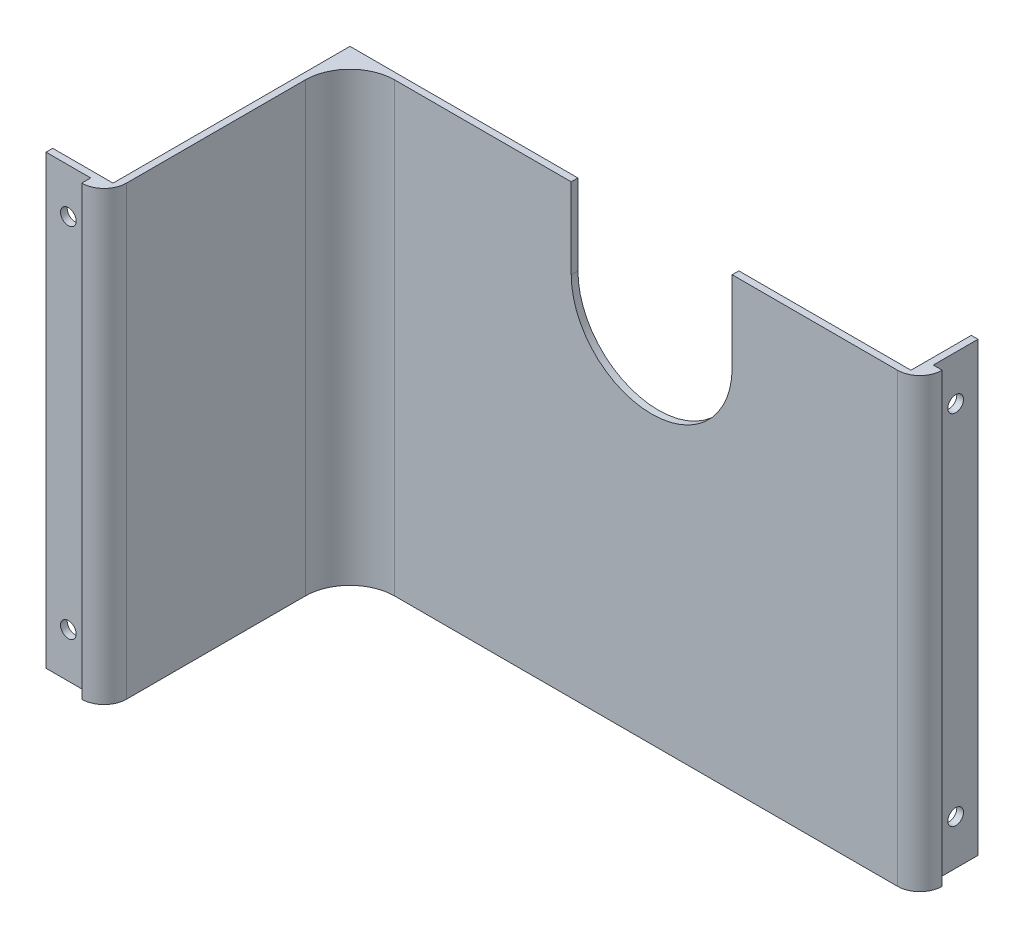
ISO-10303-21;
HEADER;
FILE_DESCRIPTION(('STEP AP214'),'2;1');
FILE_NAME('part.step','',(''),(''),'','','');
FILE_SCHEMA(('AUTOMOTIVE_DESIGN { 1 0 10303 214 1 1 1 1 }'));
ENDSEC;
DATA;
#1=APPLICATION_CONTEXT('core data for automotive mechanical design processes');
#2=APPLICATION_PROTOCOL_DEFINITION('international standard','automotive_design',2000,#1);
#3=PRODUCT_CONTEXT('',#1,'mechanical');
#4=PRODUCT('Part','Part','',(#3));
#5=PRODUCT_RELATED_PRODUCT_CATEGORY('part','',(#4));
#6=PRODUCT_DEFINITION_FORMATION('','',#4);
#7=PRODUCT_DEFINITION_CONTEXT('part definition',#1,'design');
#8=PRODUCT_DEFINITION('design','',#6,#7);
#9=PRODUCT_DEFINITION_SHAPE('','',#8);
#10=(LENGTH_UNIT() NAMED_UNIT(*) SI_UNIT(.MILLI.,.METRE.));
#11=(NAMED_UNIT(*) PLANE_ANGLE_UNIT() SI_UNIT($,.RADIAN.));
#12=(NAMED_UNIT(*) SI_UNIT($,.STERADIAN.) SOLID_ANGLE_UNIT());
#13=UNCERTAINTY_MEASURE_WITH_UNIT(LENGTH_MEASURE(1.E-05),#10,'distance_accuracy_value','');
#14=(GEOMETRIC_REPRESENTATION_CONTEXT(3) GLOBAL_UNCERTAINTY_ASSIGNED_CONTEXT((#13)) GLOBAL_UNIT_ASSIGNED_CONTEXT((#10,
#11,#12)) REPRESENTATION_CONTEXT('',''));
#15=CARTESIAN_POINT('',(0.,0.,0.));
#16=DIRECTION('',(0.,0.,1.));
#17=DIRECTION('',(1.,0.,0.));
#18=AXIS2_PLACEMENT_3D('',#15,#16,#17);
#19=CARTESIAN_POINT('',(-6.10622663543836E-13,100.,-4.99999999999999));
#20=DIRECTION('',(0.,1.,0.));
#21=DIRECTION('',(0.,0.,1.));
#22=AXIS2_PLACEMENT_3D('',#19,#20,#21);
#23=PLANE('',#22);
#24=DIRECTION('',(0.,0.,1.));
#25=VECTOR('',#24,1.);
#26=CARTESIAN_POINT('',(-73.,100.,-5.));
#27=LINE('',#26,#25);
#28=CARTESIAN_POINT('',(-73.,100.,-1.5));
#29=VERTEX_POINT('',#28);
#30=CARTESIAN_POINT('',(-73.0000000000003,100.,0.));
#31=VERTEX_POINT('',#30);
#32=EDGE_CURVE('E11',#29,#31,#27,.T.);
#33=ORIENTED_EDGE('',*,*,#32,.F.);
#34=DIRECTION('',(-1.,0.,0.));
#35=VECTOR('',#34,1.);
#36=CARTESIAN_POINT('',(-124.,100.,-1.49999999999999));
#37=LINE('',#36,#35);
#38=CARTESIAN_POINT('',(-124.,100.,-1.49999999999999));
#39=VERTEX_POINT('',#38);
#40=EDGE_CURVE('E321',#29,#39,#37,.T.);
#41=ORIENTED_EDGE('',*,*,#40,.T.);
#42=DIRECTION('',(0.,0.,1.));
#43=VECTOR('',#42,1.);
#44=CARTESIAN_POINT('',(-124.,100.,51.5));
#45=LINE('',#44,#43);
#46=CARTESIAN_POINT('',(-124.,100.,51.5));
#47=VERTEX_POINT('',#46);
#48=EDGE_CURVE('E324',#39,#47,#45,.T.);
#49=ORIENTED_EDGE('',*,*,#48,.T.);
#50=DIRECTION('',(-1.,0.,0.));
#51=VECTOR('',#50,1.);
#52=CARTESIAN_POINT('',(-137.5,100.,51.5));
#53=LINE('',#52,#51);
#54=CARTESIAN_POINT('',(-137.5,100.,51.5));
#55=VERTEX_POINT('',#54);
#56=EDGE_CURVE('E327',#47,#55,#53,.T.);
#57=ORIENTED_EDGE('',*,*,#56,.T.);
#58=DIRECTION('',(0.,0.,1.));
#59=VECTOR('',#58,1.);
#60=CARTESIAN_POINT('',(-137.5,100.,53.));
#61=LINE('',#60,#59);
#62=CARTESIAN_POINT('',(-137.5,100.,53.));
#63=VERTEX_POINT('',#62);
#64=EDGE_CURVE('E330',#55,#63,#61,.T.);
#65=ORIENTED_EDGE('',*,*,#64,.T.);
#66=DIRECTION('',(1.,0.,0.));
#67=VECTOR('',#66,1.);
#68=CARTESIAN_POINT('',(-127.5,100.,53.));
#69=LINE('',#68,#67);
#70=CARTESIAN_POINT('',(-127.5,100.,53.));
#71=VERTEX_POINT('',#70);
#72=EDGE_CURVE('E333',#63,#71,#69,.T.);
#73=ORIENTED_EDGE('',*,*,#72,.T.);
#74=DIRECTION('',(0.,0.,1.));
#75=VECTOR('',#74,1.);
#76=CARTESIAN_POINT('',(-127.5,100.,55.));
#77=LINE('',#76,#75);
#78=CARTESIAN_POINT('',(-127.5,100.,55.));
#79=VERTEX_POINT('',#78);
#80=EDGE_CURVE('E187',#71,#79,#77,.T.);
#81=ORIENTED_EDGE('',*,*,#80,.T.);
#82=CARTESIAN_POINT('',(-127.5,100.,50.));
#83=DIRECTION('',(0.,1.,0.));
#84=DIRECTION('',(0.,0.,-1.));
#85=AXIS2_PLACEMENT_3D('',#82,#83,#84);
#86=CIRCLE('',#85,5.00000000000001);
#87=CARTESIAN_POINT('',(-122.5,100.,50.));
#88=VERTEX_POINT('',#87);
#89=EDGE_CURVE('E185',#79,#88,#86,.T.);
#90=ORIENTED_EDGE('',*,*,#89,.T.);
#91=DIRECTION('',(0.,0.,-1.));
#92=VECTOR('',#91,1.);
#93=CARTESIAN_POINT('',(-122.5,100.,10.));
#94=LINE('',#93,#92);
#95=CARTESIAN_POINT('',(-122.5,100.,9.99999999999999));
#96=VERTEX_POINT('',#95);
#97=EDGE_CURVE('E167',#88,#96,#94,.T.);
#98=ORIENTED_EDGE('',*,*,#97,.T.);
#99=CARTESIAN_POINT('',(-112.5,100.,10.));
#100=DIRECTION('',(0.,-1.,0.));
#101=DIRECTION('',(0.,0.,1.));
#102=AXIS2_PLACEMENT_3D('',#99,#100,#101);
#103=CIRCLE('',#102,9.99999999999999);
#104=CARTESIAN_POINT('',(-112.5,100.,0.));
#105=VERTEX_POINT('',#104);
#106=EDGE_CURVE('E176',#96,#105,#103,.T.);
#107=ORIENTED_EDGE('',*,*,#106,.T.);
#108=DIRECTION('',(1.,0.,0.));
#109=VECTOR('',#108,1.);
#110=CARTESIAN_POINT('',(0.,100.,0.));
#111=LINE('',#110,#109);
#112=EDGE_CURVE('E191',#105,#31,#111,.T.);
#113=ORIENTED_EDGE('',*,*,#112,.T.);
#114=EDGE_LOOP('',(#33,#41,#49,#57,#65,#73,#81,#90,#98,#107,#113));
#115=FACE_BOUND('',#114,.T.);
#116=ADVANCED_FACE('F37',(#115),#23,.T.);
#117=CARTESIAN_POINT('',(-6.10622663543836E-13,100.,-4.99999999999999));
#118=DIRECTION('',(0.,-1.,0.));
#119=DIRECTION('',(0.,0.,-1.));
#120=AXIS2_PLACEMENT_3D('',#117,#118,#119);
#121=CYLINDRICAL_SURFACE('',#120,5.);
#122=CARTESIAN_POINT('',(-6.10622663543836E-13,3.05311331771918E-13,-5.));
#123=DIRECTION('',(0.,1.,0.));
#124=DIRECTION('',(0.,0.,1.));
#125=AXIS2_PLACEMENT_3D('',#122,#123,#124);
#126=CIRCLE('',#125,5.);
#127=CARTESIAN_POINT('',(0.,0.,0.));
#128=VERTEX_POINT('',#127);
#129=CARTESIAN_POINT('',(4.99999999999939,3.05311331771918E-13,-5.00000000000002));
#130=VERTEX_POINT('',#129);
#131=EDGE_CURVE('E194',#128,#130,#126,.T.);
#132=ORIENTED_EDGE('',*,*,#131,.T.);
#133=DIRECTION('',(0.,-1.,0.));
#134=VECTOR('',#133,1.);
#135=CARTESIAN_POINT('',(4.99999999999939,100.,-5.));
#136=LINE('',#135,#134);
#137=CARTESIAN_POINT('',(4.99999999999939,100.,-5.));
#138=VERTEX_POINT('',#137);
#139=EDGE_CURVE('E269',#138,#130,#136,.T.);
#140=ORIENTED_EDGE('',*,*,#139,.F.);
#141=CARTESIAN_POINT('',(-6.10622663543836E-13,100.,-4.99999999999999));
#142=DIRECTION('',(0.,1.,0.));
#143=DIRECTION('',(0.,0.,1.));
#144=AXIS2_PLACEMENT_3D('',#141,#142,#143);
#145=CIRCLE('',#144,5.);
#146=CARTESIAN_POINT('',(0.,100.,0.));
#147=VERTEX_POINT('',#146);
#148=EDGE_CURVE('E235',#147,#138,#145,.T.);
#149=ORIENTED_EDGE('',*,*,#148,.F.);
#150=DIRECTION('',(0.,-1.,0.));
#151=VECTOR('',#150,1.);
#152=CARTESIAN_POINT('',(0.,100.,0.));
#153=LINE('',#152,#151);
#154=EDGE_CURVE('E193',#147,#128,#153,.T.);
#155=ORIENTED_EDGE('',*,*,#154,.T.);
#156=EDGE_LOOP('',(#132,#140,#149,#155));
#157=FACE_BOUND('',#156,.T.);
#158=ADVANCED_FACE('F39',(#157),#121,.T.);
#159=CARTESIAN_POINT('',(4.99999999999939,100.,-5.));
#160=DIRECTION('',(0.,0.,1.));
#161=DIRECTION('',(1.,0.,0.));
#162=AXIS2_PLACEMENT_3D('',#159,#160,#161);
#163=PLANE('',#162);
#164=DIRECTION('',(-1.,0.,0.));
#165=VECTOR('',#164,1.);
#166=CARTESIAN_POINT('',(4.99999999999939,3.05311331771918E-13,-5.00000000000002));
#167=LINE('',#166,#165);
#168=CARTESIAN_POINT('',(2.99999999999939,3.05311331771918E-13,-5.));
#169=VERTEX_POINT('',#168);
#170=EDGE_CURVE('E197',#130,#169,#167,.T.);
#171=ORIENTED_EDGE('',*,*,#170,.T.);
#172=DIRECTION('',(0.,-1.,0.));
#173=VECTOR('',#172,1.);
#174=CARTESIAN_POINT('',(2.99999999999939,100.,-5.));
#175=LINE('',#174,#173);
#176=CARTESIAN_POINT('',(2.99999999999939,100.,-5.));
#177=VERTEX_POINT('',#176);
#178=EDGE_CURVE('E266',#177,#169,#175,.T.);
#179=ORIENTED_EDGE('',*,*,#178,.F.);
#180=DIRECTION('',(-1.,0.,0.));
#181=VECTOR('',#180,1.);
#182=CARTESIAN_POINT('',(4.99999999999939,100.,-5.));
#183=LINE('',#182,#181);
#184=EDGE_CURVE('E122',#138,#177,#183,.T.);
#185=ORIENTED_EDGE('',*,*,#184,.F.);
#186=ORIENTED_EDGE('',*,*,#139,.T.);
#187=EDGE_LOOP('',(#171,#179,#185,#186));
#188=FACE_BOUND('',#187,.T.);
#189=ADVANCED_FACE('F382',(#188),#163,.F.);
#190=CARTESIAN_POINT('',(2.99999999999939,100.,-5.));
#191=DIRECTION('',(-1.,0.,0.));
#192=DIRECTION('',(0.,0.,1.));
#193=AXIS2_PLACEMENT_3D('',#190,#191,#192);
#194=PLANE('',#193);
#195=CARTESIAN_POINT('',(2.99999999999998,90.,-10.));
#196=DIRECTION('',(1.,0.,0.));
#197=DIRECTION('',(0.,0.,-1.));
#198=AXIS2_PLACEMENT_3D('',#195,#196,#197);
#199=CIRCLE('',#198,1.75);
#200=CARTESIAN_POINT('',(2.99999999999998,90.,-11.75));
#201=VERTEX_POINT('',#200);
#202=EDGE_CURVE('E273',#201,#201,#199,.T.);
#203=ORIENTED_EDGE('',*,*,#202,.F.);
#204=EDGE_LOOP('',(#203));
#205=FACE_BOUND('',#204,.T.);
#206=CARTESIAN_POINT('',(2.99999999999998,9.99999999999999,-10.));
#207=DIRECTION('',(1.,0.,0.));
#208=DIRECTION('',(0.,0.,1.));
#209=AXIS2_PLACEMENT_3D('',#206,#207,#208);
#210=CIRCLE('',#209,1.75);
#211=CARTESIAN_POINT('',(2.99999999999998,9.99999999999999,-8.25000000000002));
#212=VERTEX_POINT('',#211);
#213=EDGE_CURVE('E279',#212,#212,#210,.T.);
#214=ORIENTED_EDGE('',*,*,#213,.F.);
#215=EDGE_LOOP('',(#214));
#216=FACE_BOUND('',#215,.T.);
#217=DIRECTION('',(0.,0.,-1.));
#218=VECTOR('',#217,1.);
#219=CARTESIAN_POINT('',(2.99999999999939,3.05311331771918E-13,-5.));
#220=LINE('',#219,#218);
#221=CARTESIAN_POINT('',(3.,3.05311331771918E-13,-15.));
#222=VERTEX_POINT('',#221);
#223=EDGE_CURVE('E201',#169,#222,#220,.T.);
#224=ORIENTED_EDGE('',*,*,#223,.T.);
#225=DIRECTION('',(0.,-1.,0.));
#226=VECTOR('',#225,1.);
#227=CARTESIAN_POINT('',(3.,100.,-15.));
#228=LINE('',#227,#226);
#229=CARTESIAN_POINT('',(3.,100.,-15.));
#230=VERTEX_POINT('',#229);
#231=EDGE_CURVE('E263',#230,#222,#228,.T.);
#232=ORIENTED_EDGE('',*,*,#231,.F.);
#233=DIRECTION('',(0.,0.,-1.));
#234=VECTOR('',#233,1.);
#235=CARTESIAN_POINT('',(2.99999999999939,100.,-5.));
#236=LINE('',#235,#234);
#237=EDGE_CURVE('E312',#177,#230,#236,.T.);
#238=ORIENTED_EDGE('',*,*,#237,.F.);
#239=ORIENTED_EDGE('',*,*,#178,.T.);
#240=EDGE_LOOP('',(#224,#232,#238,#239));
#241=FACE_BOUND('',#240,.T.);
#242=ADVANCED_FACE('F381',(#205,#216,#241),#194,.F.);
#243=CARTESIAN_POINT('',(3.,100.,-15.));
#244=DIRECTION('',(0.,0.,1.));
#245=DIRECTION('',(1.,0.,0.));
#246=AXIS2_PLACEMENT_3D('',#243,#244,#245);
#247=PLANE('',#246);
#248=DIRECTION('',(-1.,0.,0.));
#249=VECTOR('',#248,1.);
#250=CARTESIAN_POINT('',(3.,3.05311331771918E-13,-15.));
#251=LINE('',#250,#249);
#252=CARTESIAN_POINT('',(1.5,3.05311331771918E-13,-15.));
#253=VERTEX_POINT('',#252);
#254=EDGE_CURVE('E204',#222,#253,#251,.T.);
#255=ORIENTED_EDGE('',*,*,#254,.T.);
#256=DIRECTION('',(0.,-1.,0.));
#257=VECTOR('',#256,1.);
#258=CARTESIAN_POINT('',(1.5,100.,-15.));
#259=LINE('',#258,#257);
#260=CARTESIAN_POINT('',(1.5,100.,-15.));
#261=VERTEX_POINT('',#260);
#262=EDGE_CURVE('E260',#261,#253,#259,.T.);
#263=ORIENTED_EDGE('',*,*,#262,.F.);
#264=DIRECTION('',(-1.,0.,0.));
#265=VECTOR('',#264,1.);
#266=CARTESIAN_POINT('',(3.,100.,-15.));
#267=LINE('',#266,#265);
#268=EDGE_CURVE('E315',#230,#261,#267,.T.);
#269=ORIENTED_EDGE('',*,*,#268,.F.);
#270=ORIENTED_EDGE('',*,*,#231,.T.);
#271=EDGE_LOOP('',(#255,#263,#269,#270));
#272=FACE_BOUND('',#271,.T.);
#273=ADVANCED_FACE('F378',(#272),#247,.F.);
#274=CARTESIAN_POINT('',(1.5,100.,-15.));
#275=DIRECTION('',(1.,0.,0.));
#276=DIRECTION('',(0.,0.,-1.));
#277=AXIS2_PLACEMENT_3D('',#274,#275,#276);
#278=PLANE('',#277);
#279=CARTESIAN_POINT('',(1.49999999999997,90.,-10.));
#280=DIRECTION('',(1.,0.,0.));
#281=DIRECTION('',(0.,0.,-1.));
#282=AXIS2_PLACEMENT_3D('',#279,#280,#281);
#283=CIRCLE('',#282,1.75);
#284=CARTESIAN_POINT('',(1.49999999999997,90.,-11.75));
#285=VERTEX_POINT('',#284);
#286=EDGE_CURVE('E41',#285,#285,#283,.T.);
#287=ORIENTED_EDGE('',*,*,#286,.T.);
#288=EDGE_LOOP('',(#287));
#289=FACE_BOUND('',#288,.T.);
#290=CARTESIAN_POINT('',(1.49999999999997,9.99999999999999,-10.));
#291=DIRECTION('',(1.,0.,0.));
#292=DIRECTION('',(0.,0.,-1.));
#293=AXIS2_PLACEMENT_3D('',#290,#291,#292);
#294=CIRCLE('',#293,1.75);
#295=CARTESIAN_POINT('',(1.49999999999997,9.99999999999999,-11.75));
#296=VERTEX_POINT('',#295);
#297=EDGE_CURVE('E271',#296,#296,#294,.T.);
#298=ORIENTED_EDGE('',*,*,#297,.T.);
#299=EDGE_LOOP('',(#298));
#300=FACE_BOUND('',#299,.T.);
#301=DIRECTION('',(0.,0.,1.));
#302=VECTOR('',#301,1.);
#303=CARTESIAN_POINT('',(1.5,3.05311331771918E-13,-15.));
#304=LINE('',#303,#302);
#305=CARTESIAN_POINT('',(1.49999999999939,3.05311331771918E-13,-1.5));
#306=VERTEX_POINT('',#305);
#307=EDGE_CURVE('E207',#253,#306,#304,.T.);
#308=ORIENTED_EDGE('',*,*,#307,.T.);
#309=DIRECTION('',(0.,-1.,0.));
#310=VECTOR('',#309,1.);
#311=CARTESIAN_POINT('',(1.49999999999939,100.,-1.5));
#312=LINE('',#311,#310);
#313=CARTESIAN_POINT('',(1.49999999999939,100.,-1.5));
#314=VERTEX_POINT('',#313);
#315=EDGE_CURVE('E257',#314,#306,#312,.T.);
#316=ORIENTED_EDGE('',*,*,#315,.F.);
#317=DIRECTION('',(0.,0.,1.));
#318=VECTOR('',#317,1.);
#319=CARTESIAN_POINT('',(1.5,100.,-15.));
#320=LINE('',#319,#318);
#321=EDGE_CURVE('E318',#261,#314,#320,.T.);
#322=ORIENTED_EDGE('',*,*,#321,.F.);
#323=ORIENTED_EDGE('',*,*,#262,.T.);
#324=EDGE_LOOP('',(#308,#316,#322,#323));
#325=FACE_BOUND('',#324,.T.);
#326=ADVANCED_FACE('F375',(#289,#300,#325),#278,.F.);
#327=CARTESIAN_POINT('',(-124.,100.,-1.49999999999999));
#328=DIRECTION('',(0.,0.,1.));
#329=DIRECTION('',(1.,0.,0.));
#330=AXIS2_PLACEMENT_3D('',#327,#328,#329);
#331=PLANE('',#330);
#332=ORIENTED_EDGE('',*,*,#40,.F.);
#333=DIRECTION('',(0.,-1.,0.));
#334=VECTOR('',#333,1.);
#335=CARTESIAN_POINT('',(-73.,100.,-1.5));
#336=LINE('',#335,#334);
#337=CARTESIAN_POINT('',(-73.,82.,-1.5));
#338=VERTEX_POINT('',#337);
#339=EDGE_CURVE('E305',#29,#338,#336,.T.);
#340=ORIENTED_EDGE('',*,*,#339,.T.);
#341=CARTESIAN_POINT('',(-55.,82.0000008613909,-1.5));
#342=DIRECTION('',(0.,0.,1.));
#343=DIRECTION('',(1.,0.,0.));
#344=AXIS2_PLACEMENT_3D('',#341,#342,#343);
#345=CIRCLE('',#344,18.);
#346=CARTESIAN_POINT('',(-37.,82.0000017227817,-1.5));
#347=VERTEX_POINT('',#346);
#348=EDGE_CURVE('E198',#338,#347,#345,.T.);
#349=ORIENTED_EDGE('',*,*,#348,.T.);
#350=DIRECTION('',(0.,1.,0.));
#351=VECTOR('',#350,1.);
#352=CARTESIAN_POINT('',(-37.,100.,-1.5));
#353=LINE('',#352,#351);
#354=CARTESIAN_POINT('',(-37.,100.,-1.5));
#355=VERTEX_POINT('',#354);
#356=EDGE_CURVE('E300',#347,#355,#353,.T.);
#357=ORIENTED_EDGE('',*,*,#356,.T.);
#358=EDGE_CURVE('E322',#314,#355,#37,.T.);
#359=ORIENTED_EDGE('',*,*,#358,.F.);
#360=ORIENTED_EDGE('',*,*,#315,.T.);
#361=DIRECTION('',(-1.,0.,0.));
#362=VECTOR('',#361,1.);
#363=CARTESIAN_POINT('',(-124.,3.05311331771918E-13,-1.5));
#364=LINE('',#363,#362);
#365=CARTESIAN_POINT('',(-124.,3.05311331771918E-13,-1.5));
#366=VERTEX_POINT('',#365);
#367=EDGE_CURVE('E210',#306,#366,#364,.T.);
#368=ORIENTED_EDGE('',*,*,#367,.T.);
#369=DIRECTION('',(0.,-1.,0.));
#370=VECTOR('',#369,1.);
#371=CARTESIAN_POINT('',(-124.,100.,-1.49999999999999));
#372=LINE('',#371,#370);
#373=EDGE_CURVE('E254',#39,#366,#372,.T.);
#374=ORIENTED_EDGE('',*,*,#373,.F.);
#375=EDGE_LOOP('',(#332,#340,#349,#357,#359,#360,#368,#374));
#376=FACE_BOUND('',#375,.T.);
#377=ADVANCED_FACE('F361',(#376),#331,.F.);
#378=CARTESIAN_POINT('',(-124.,100.,51.5));
#379=DIRECTION('',(1.,0.,0.));
#380=DIRECTION('',(0.,0.,-1.));
#381=AXIS2_PLACEMENT_3D('',#378,#379,#380);
#382=PLANE('',#381);
#383=DIRECTION('',(0.,0.,1.));
#384=VECTOR('',#383,1.);
#385=CARTESIAN_POINT('',(-124.,0.,51.5));
#386=LINE('',#385,#384);
#387=CARTESIAN_POINT('',(-124.,0.,51.5));
#388=VERTEX_POINT('',#387);
#389=EDGE_CURVE('E213',#366,#388,#386,.T.);
#390=ORIENTED_EDGE('',*,*,#389,.T.);
#391=DIRECTION('',(0.,-1.,0.));
#392=VECTOR('',#391,1.);
#393=CARTESIAN_POINT('',(-124.,100.,51.5));
#394=LINE('',#393,#392);
#395=EDGE_CURVE('E251',#47,#388,#394,.T.);
#396=ORIENTED_EDGE('',*,*,#395,.F.);
#397=ORIENTED_EDGE('',*,*,#48,.F.);
#398=ORIENTED_EDGE('',*,*,#373,.T.);
#399=EDGE_LOOP('',(#390,#396,#397,#398));
#400=FACE_BOUND('',#399,.T.);
#401=ADVANCED_FACE('F365',(#400),#382,.F.);
#402=CARTESIAN_POINT('',(-137.5,100.,51.5));
#403=DIRECTION('',(0.,0.,1.));
#404=DIRECTION('',(1.,0.,0.));
#405=AXIS2_PLACEMENT_3D('',#402,#403,#404);
#406=PLANE('',#405);
#407=CARTESIAN_POINT('',(-132.5,90.,51.5));
#408=DIRECTION('',(0.,0.,1.));
#409=DIRECTION('',(1.,0.,0.));
#410=AXIS2_PLACEMENT_3D('',#407,#408,#409);
#411=CIRCLE('',#410,1.75000000000001);
#412=CARTESIAN_POINT('',(-130.75,90.,51.5));
#413=VERTEX_POINT('',#412);
#414=EDGE_CURVE('E284',#413,#413,#411,.T.);
#415=ORIENTED_EDGE('',*,*,#414,.T.);
#416=EDGE_LOOP('',(#415));
#417=FACE_BOUND('',#416,.T.);
#418=CARTESIAN_POINT('',(-132.5,9.99999999999999,51.5));
#419=DIRECTION('',(0.,0.,1.));
#420=DIRECTION('',(1.,0.,0.));
#421=AXIS2_PLACEMENT_3D('',#418,#419,#420);
#422=CIRCLE('',#421,1.75000000000001);
#423=CARTESIAN_POINT('',(-130.75,9.99999999999999,51.5));
#424=VERTEX_POINT('',#423);
#425=EDGE_CURVE('E535',#424,#424,#422,.T.);
#426=ORIENTED_EDGE('',*,*,#425,.T.);
#427=EDGE_LOOP('',(#426));
#428=FACE_BOUND('',#427,.T.);
#429=DIRECTION('',(-1.,0.,0.));
#430=VECTOR('',#429,1.);
#431=CARTESIAN_POINT('',(-137.5,0.,51.5));
#432=LINE('',#431,#430);
#433=CARTESIAN_POINT('',(-137.5,0.,51.5));
#434=VERTEX_POINT('',#433);
#435=EDGE_CURVE('E216',#388,#434,#432,.T.);
#436=ORIENTED_EDGE('',*,*,#435,.T.);
#437=DIRECTION('',(0.,-1.,0.));
#438=VECTOR('',#437,1.);
#439=CARTESIAN_POINT('',(-137.5,100.,51.5));
#440=LINE('',#439,#438);
#441=EDGE_CURVE('E248',#55,#434,#440,.T.);
#442=ORIENTED_EDGE('',*,*,#441,.F.);
#443=ORIENTED_EDGE('',*,*,#56,.F.);
#444=ORIENTED_EDGE('',*,*,#395,.T.);
#445=EDGE_LOOP('',(#436,#442,#443,#444));
#446=FACE_BOUND('',#445,.T.);
#447=ADVANCED_FACE('F367',(#417,#428,#446),#406,.F.);
#448=CARTESIAN_POINT('',(-137.5,100.,53.));
#449=DIRECTION('',(1.,0.,0.));
#450=DIRECTION('',(0.,0.,-1.));
#451=AXIS2_PLACEMENT_3D('',#448,#449,#450);
#452=PLANE('',#451);
#453=DIRECTION('',(0.,0.,1.));
#454=VECTOR('',#453,1.);
#455=CARTESIAN_POINT('',(-137.5,0.,53.));
#456=LINE('',#455,#454);
#457=CARTESIAN_POINT('',(-137.5,0.,53.));
#458=VERTEX_POINT('',#457);
#459=EDGE_CURVE('E219',#434,#458,#456,.T.);
#460=ORIENTED_EDGE('',*,*,#459,.T.);
#461=DIRECTION('',(0.,-1.,0.));
#462=VECTOR('',#461,1.);
#463=CARTESIAN_POINT('',(-137.5,100.,53.));
#464=LINE('',#463,#462);
#465=EDGE_CURVE('E245',#63,#458,#464,.T.);
#466=ORIENTED_EDGE('',*,*,#465,.F.);
#467=ORIENTED_EDGE('',*,*,#64,.F.);
#468=ORIENTED_EDGE('',*,*,#441,.T.);
#469=EDGE_LOOP('',(#460,#466,#467,#468));
#470=FACE_BOUND('',#469,.T.);
#471=ADVANCED_FACE('F370',(#470),#452,.F.);
#472=CARTESIAN_POINT('',(-127.5,100.,53.));
#473=DIRECTION('',(0.,0.,-1.));
#474=DIRECTION('',(-1.,0.,0.));
#475=AXIS2_PLACEMENT_3D('',#472,#473,#474);
#476=PLANE('',#475);
#477=CARTESIAN_POINT('',(-132.5,90.,53.0000000000001));
#478=DIRECTION('',(0.,0.,1.));
#479=DIRECTION('',(1.,0.,0.));
#480=AXIS2_PLACEMENT_3D('',#477,#478,#479);
#481=CIRCLE('',#480,1.75000000000001);
#482=CARTESIAN_POINT('',(-130.75,90.,53.0000000000001));
#483=VERTEX_POINT('',#482);
#484=EDGE_CURVE('E532',#483,#483,#481,.T.);
#485=ORIENTED_EDGE('',*,*,#484,.F.);
#486=EDGE_LOOP('',(#485));
#487=FACE_BOUND('',#486,.T.);
#488=CARTESIAN_POINT('',(-132.5,9.99999999999999,53.0000000000001));
#489=DIRECTION('',(0.,0.,1.));
#490=DIRECTION('',(-1.,0.,0.));
#491=AXIS2_PLACEMENT_3D('',#488,#489,#490);
#492=CIRCLE('',#491,1.75000000000001);
#493=CARTESIAN_POINT('',(-134.25,9.99999999999999,53.0000000000001));
#494=VERTEX_POINT('',#493);
#495=EDGE_CURVE('E539',#494,#494,#492,.T.);
#496=ORIENTED_EDGE('',*,*,#495,.F.);
#497=EDGE_LOOP('',(#496));
#498=FACE_BOUND('',#497,.T.);
#499=DIRECTION('',(1.,0.,0.));
#500=VECTOR('',#499,1.);
#501=CARTESIAN_POINT('',(-127.5,0.,53.));
#502=LINE('',#501,#500);
#503=CARTESIAN_POINT('',(-127.5,0.,53.));
#504=VERTEX_POINT('',#503);
#505=EDGE_CURVE('E222',#458,#504,#502,.T.);
#506=ORIENTED_EDGE('',*,*,#505,.T.);
#507=DIRECTION('',(0.,-1.,0.));
#508=VECTOR('',#507,1.);
#509=CARTESIAN_POINT('',(-127.5,100.,53.));
#510=LINE('',#509,#508);
#511=EDGE_CURVE('E242',#71,#504,#510,.T.);
#512=ORIENTED_EDGE('',*,*,#511,.F.);
#513=ORIENTED_EDGE('',*,*,#72,.F.);
#514=ORIENTED_EDGE('',*,*,#465,.T.);
#515=EDGE_LOOP('',(#506,#512,#513,#514));
#516=FACE_BOUND('',#515,.T.);
#517=ADVANCED_FACE('F372',(#487,#498,#516),#476,.F.);
#518=CARTESIAN_POINT('',(-127.5,100.,55.));
#519=DIRECTION('',(1.,0.,0.));
#520=DIRECTION('',(0.,0.,-1.));
#521=AXIS2_PLACEMENT_3D('',#518,#519,#520);
#522=PLANE('',#521);
#523=DIRECTION('',(0.,0.,1.));
#524=VECTOR('',#523,1.);
#525=CARTESIAN_POINT('',(-127.5,0.,55.));
#526=LINE('',#525,#524);
#527=CARTESIAN_POINT('',(-127.5,0.,55.));
#528=VERTEX_POINT('',#527);
#529=EDGE_CURVE('E225',#504,#528,#526,.T.);
#530=ORIENTED_EDGE('',*,*,#529,.T.);
#531=DIRECTION('',(0.,-1.,0.));
#532=VECTOR('',#531,1.);
#533=CARTESIAN_POINT('',(-127.5,100.,55.));
#534=LINE('',#533,#532);
#535=EDGE_CURVE('E239',#79,#528,#534,.T.);
#536=ORIENTED_EDGE('',*,*,#535,.F.);
#537=ORIENTED_EDGE('',*,*,#80,.F.);
#538=ORIENTED_EDGE('',*,*,#511,.T.);
#539=EDGE_LOOP('',(#530,#536,#537,#538));
#540=FACE_BOUND('',#539,.T.);
#541=ADVANCED_FACE('F338',(#540),#522,.F.);
#542=CARTESIAN_POINT('',(-127.5,100.,50.));
#543=DIRECTION('',(0.,-1.,0.));
#544=DIRECTION('',(0.,0.,-1.));
#545=AXIS2_PLACEMENT_3D('',#542,#543,#544);
#546=CYLINDRICAL_SURFACE('',#545,5.00000000000001);
#547=CARTESIAN_POINT('',(-127.5,3.05311331771918E-13,50.));
#548=DIRECTION('',(0.,1.,0.));
#549=DIRECTION('',(0.,0.,-1.));
#550=AXIS2_PLACEMENT_3D('',#547,#548,#549);
#551=CIRCLE('',#550,5.00000000000001);
#552=CARTESIAN_POINT('',(-122.5,3.05311331771918E-13,50.));
#553=VERTEX_POINT('',#552);
#554=EDGE_CURVE('E228',#528,#553,#551,.T.);
#555=ORIENTED_EDGE('',*,*,#554,.T.);
#556=DIRECTION('',(0.,-1.,0.));
#557=VECTOR('',#556,1.);
#558=CARTESIAN_POINT('',(-122.5,100.,50.));
#559=LINE('',#558,#557);
#560=EDGE_CURVE('E172',#88,#553,#559,.T.);
#561=ORIENTED_EDGE('',*,*,#560,.F.);
#562=ORIENTED_EDGE('',*,*,#89,.F.);
#563=ORIENTED_EDGE('',*,*,#535,.T.);
#564=EDGE_LOOP('',(#555,#561,#562,#563));
#565=FACE_BOUND('',#564,.T.);
#566=ADVANCED_FACE('F340',(#565),#546,.T.);
#567=CARTESIAN_POINT('',(-122.5,100.,10.));
#568=DIRECTION('',(-1.,0.,0.));
#569=DIRECTION('',(0.,0.,1.));
#570=AXIS2_PLACEMENT_3D('',#567,#568,#569);
#571=PLANE('',#570);
#572=DIRECTION('',(0.,0.,-1.));
#573=VECTOR('',#572,1.);
#574=CARTESIAN_POINT('',(-122.5,0.,10.));
#575=LINE('',#574,#573);
#576=CARTESIAN_POINT('',(-122.5,0.,10.));
#577=VERTEX_POINT('',#576);
#578=EDGE_CURVE('E169',#553,#577,#575,.T.);
#579=ORIENTED_EDGE('',*,*,#578,.T.);
#580=DIRECTION('',(0.,-1.,0.));
#581=VECTOR('',#580,1.);
#582=CARTESIAN_POINT('',(-122.5,100.,9.99999999999999));
#583=LINE('',#582,#581);
#584=EDGE_CURVE('E162',#96,#577,#583,.T.);
#585=ORIENTED_EDGE('',*,*,#584,.F.);
#586=ORIENTED_EDGE('',*,*,#97,.F.);
#587=ORIENTED_EDGE('',*,*,#560,.T.);
#588=EDGE_LOOP('',(#579,#585,#586,#587));
#589=FACE_BOUND('',#588,.T.);
#590=ADVANCED_FACE('F164',(#589),#571,.F.);
#591=CARTESIAN_POINT('',(-112.5,100.,10.));
#592=DIRECTION('',(0.,-1.,0.));
#593=DIRECTION('',(0.,0.,-1.));
#594=AXIS2_PLACEMENT_3D('',#591,#592,#593);
#595=CYLINDRICAL_SURFACE('',#594,9.99999999999999);
#596=CARTESIAN_POINT('',(-112.5,0.,10.));
#597=DIRECTION('',(0.,-1.,0.));
#598=DIRECTION('',(0.,0.,1.));
#599=AXIS2_PLACEMENT_3D('',#596,#597,#598);
#600=CIRCLE('',#599,9.99999999999999);
#601=CARTESIAN_POINT('',(-112.5,0.,0.));
#602=VERTEX_POINT('',#601);
#603=EDGE_CURVE('E232',#577,#602,#600,.T.);
#604=ORIENTED_EDGE('',*,*,#603,.T.);
#605=DIRECTION('',(0.,-1.,0.));
#606=VECTOR('',#605,1.);
#607=CARTESIAN_POINT('',(-112.5,100.,0.));
#608=LINE('',#607,#606);
#609=EDGE_CURVE('E173',#105,#602,#608,.T.);
#610=ORIENTED_EDGE('',*,*,#609,.F.);
#611=ORIENTED_EDGE('',*,*,#106,.F.);
#612=ORIENTED_EDGE('',*,*,#584,.T.);
#613=EDGE_LOOP('',(#604,#610,#611,#612));
#614=FACE_BOUND('',#613,.T.);
#615=ADVANCED_FACE('F177',(#614),#595,.F.);
#616=CARTESIAN_POINT('',(0.,100.,0.));
#617=DIRECTION('',(0.,0.,-1.));
#618=DIRECTION('',(-1.,0.,0.));
#619=AXIS2_PLACEMENT_3D('',#616,#617,#618);
#620=PLANE('',#619);
#621=CARTESIAN_POINT('',(-55.,82.0000008613909,0.));
#622=DIRECTION('',(0.,0.,1.));
#623=DIRECTION('',(1.,0.,0.));
#624=AXIS2_PLACEMENT_3D('',#621,#622,#623);
#625=CIRCLE('',#624,18.);
#626=CARTESIAN_POINT('',(-73.0000000000003,82.,0.));
#627=VERTEX_POINT('',#626);
#628=CARTESIAN_POINT('',(-37.,82.0000017227817,0.));
#629=VERTEX_POINT('',#628);
#630=EDGE_CURVE('E277',#627,#629,#625,.T.);
#631=ORIENTED_EDGE('',*,*,#630,.F.);
#632=DIRECTION('',(0.,-1.,0.));
#633=VECTOR('',#632,1.);
#634=CARTESIAN_POINT('',(-73.0000000000003,82.,0.));
#635=LINE('',#634,#633);
#636=EDGE_CURVE('E293',#31,#627,#635,.T.);
#637=ORIENTED_EDGE('',*,*,#636,.F.);
#638=ORIENTED_EDGE('',*,*,#112,.F.);
#639=ORIENTED_EDGE('',*,*,#609,.T.);
#640=DIRECTION('',(1.,0.,0.));
#641=VECTOR('',#640,1.);
#642=CARTESIAN_POINT('',(0.,0.,0.));
#643=LINE('',#642,#641);
#644=EDGE_CURVE('E113',#602,#128,#643,.T.);
#645=ORIENTED_EDGE('',*,*,#644,.T.);
#646=ORIENTED_EDGE('',*,*,#154,.F.);
#647=CARTESIAN_POINT('',(-37.,100.,0.));
#648=VERTEX_POINT('',#647);
#649=EDGE_CURVE('E59',#648,#147,#111,.T.);
#650=ORIENTED_EDGE('',*,*,#649,.F.);
#651=DIRECTION('',(0.,1.,0.));
#652=VECTOR('',#651,1.);
#653=CARTESIAN_POINT('',(-37.,100.,0.));
#654=LINE('',#653,#652);
#655=EDGE_CURVE('E291',#629,#648,#654,.T.);
#656=ORIENTED_EDGE('',*,*,#655,.F.);
#657=EDGE_LOOP('',(#631,#637,#638,#639,#645,#646,#650,#656));
#658=FACE_BOUND('',#657,.T.);
#659=ADVANCED_FACE('F345',(#658),#620,.F.);
#660=DIRECTION('',(0.,0.,-1.));
#661=VECTOR('',#660,1.);
#662=CARTESIAN_POINT('',(-37.0000000000006,100.,-5.));
#663=LINE('',#662,#661);
#664=EDGE_CURVE('E46',#648,#355,#663,.T.);
#665=ORIENTED_EDGE('',*,*,#664,.F.);
#666=ORIENTED_EDGE('',*,*,#649,.T.);
#667=ORIENTED_EDGE('',*,*,#148,.T.);
#668=ORIENTED_EDGE('',*,*,#184,.T.);
#669=ORIENTED_EDGE('',*,*,#237,.T.);
#670=ORIENTED_EDGE('',*,*,#268,.T.);
#671=ORIENTED_EDGE('',*,*,#321,.T.);
#672=ORIENTED_EDGE('',*,*,#358,.T.);
#673=EDGE_LOOP('',(#665,#666,#667,#668,#669,#670,#671,#672));
#674=FACE_BOUND('',#673,.T.);
#675=ADVANCED_FACE('F398',(#674),#23,.T.);
#676=CARTESIAN_POINT('',(-6.10622663543836E-13,3.05311331771918E-13,-5.));
#677=DIRECTION('',(0.,1.,0.));
#678=DIRECTION('',(0.,0.,1.));
#679=AXIS2_PLACEMENT_3D('',#676,#677,#678);
#680=PLANE('',#679);
#681=ORIENTED_EDGE('',*,*,#131,.F.);
#682=ORIENTED_EDGE('',*,*,#644,.F.);
#683=ORIENTED_EDGE('',*,*,#603,.F.);
#684=ORIENTED_EDGE('',*,*,#578,.F.);
#685=ORIENTED_EDGE('',*,*,#554,.F.);
#686=ORIENTED_EDGE('',*,*,#529,.F.);
#687=ORIENTED_EDGE('',*,*,#505,.F.);
#688=ORIENTED_EDGE('',*,*,#459,.F.);
#689=ORIENTED_EDGE('',*,*,#435,.F.);
#690=ORIENTED_EDGE('',*,*,#389,.F.);
#691=ORIENTED_EDGE('',*,*,#367,.F.);
#692=ORIENTED_EDGE('',*,*,#307,.F.);
#693=ORIENTED_EDGE('',*,*,#254,.F.);
#694=ORIENTED_EDGE('',*,*,#223,.F.);
#695=ORIENTED_EDGE('',*,*,#170,.F.);
#696=EDGE_LOOP('',(#681,#682,#683,#684,#685,#686,#687,#688,#689,#690,#691,#692,#693,#694,#695));
#697=FACE_BOUND('',#696,.T.);
#698=ADVANCED_FACE('F343',(#697),#680,.F.);
#699=CARTESIAN_POINT('',(-55.,82.0000008613909,-10.));
#700=DIRECTION('',(0.,0.,1.));
#701=DIRECTION('',(1.,0.,0.));
#702=AXIS2_PLACEMENT_3D('',#699,#700,#701);
#703=CYLINDRICAL_SURFACE('',#702,18.);
#704=DIRECTION('',(0.,0.,1.));
#705=VECTOR('',#704,1.);
#706=CARTESIAN_POINT('',(-73.0000000000003,82.,-10.));
#707=LINE('',#706,#705);
#708=EDGE_CURVE('E297',#338,#627,#707,.T.);
#709=ORIENTED_EDGE('',*,*,#708,.T.);
#710=ORIENTED_EDGE('',*,*,#630,.T.);
#711=DIRECTION('',(0.,0.,1.));
#712=VECTOR('',#711,1.);
#713=CARTESIAN_POINT('',(-37.,82.0000017227817,-10.));
#714=LINE('',#713,#712);
#715=EDGE_CURVE('E296',#347,#629,#714,.T.);
#716=ORIENTED_EDGE('',*,*,#715,.F.);
#717=ORIENTED_EDGE('',*,*,#348,.F.);
#718=EDGE_LOOP('',(#709,#710,#716,#717));
#719=FACE_BOUND('',#718,.T.);
#720=ADVANCED_FACE('F391',(#719),#703,.F.);
#721=CARTESIAN_POINT('',(-73.0000000000003,82.,-10.));
#722=DIRECTION('',(-1.,0.,0.));
#723=DIRECTION('',(0.,0.,1.));
#724=AXIS2_PLACEMENT_3D('',#721,#722,#723);
#725=PLANE('',#724);
#726=ORIENTED_EDGE('',*,*,#32,.T.);
#727=ORIENTED_EDGE('',*,*,#636,.T.);
#728=ORIENTED_EDGE('',*,*,#708,.F.);
#729=ORIENTED_EDGE('',*,*,#339,.F.);
#730=EDGE_LOOP('',(#726,#727,#728,#729));
#731=FACE_BOUND('',#730,.T.);
#732=ADVANCED_FACE('F355',(#731),#725,.F.);
#733=CARTESIAN_POINT('',(-37.,100.,-10.));
#734=DIRECTION('',(1.,0.,0.));
#735=DIRECTION('',(0.,0.,-1.));
#736=AXIS2_PLACEMENT_3D('',#733,#734,#735);
#737=PLANE('',#736);
#738=ORIENTED_EDGE('',*,*,#715,.T.);
#739=ORIENTED_EDGE('',*,*,#655,.T.);
#740=ORIENTED_EDGE('',*,*,#664,.T.);
#741=ORIENTED_EDGE('',*,*,#356,.F.);
#742=EDGE_LOOP('',(#738,#739,#740,#741));
#743=FACE_BOUND('',#742,.T.);
#744=ADVANCED_FACE('F397',(#743),#737,.F.);
#745=CARTESIAN_POINT('',(-7.00000000000001,9.99999999999999,-10.));
#746=DIRECTION('',(1.,0.,0.));
#747=DIRECTION('',(0.,0.,-1.));
#748=AXIS2_PLACEMENT_3D('',#745,#746,#747);
#749=CYLINDRICAL_SURFACE('',#748,1.75);
#750=ORIENTED_EDGE('',*,*,#213,.T.);
#751=EDGE_LOOP('',(#750));
#752=FACE_BOUND('',#751,.T.);
#753=ORIENTED_EDGE('',*,*,#297,.F.);
#754=EDGE_LOOP('',(#753));
#755=FACE_BOUND('',#754,.T.);
#756=ADVANCED_FACE('F487',(#752,#755),#749,.F.);
#757=CARTESIAN_POINT('',(-7.00000000000001,90.,-10.));
#758=DIRECTION('',(1.,0.,0.));
#759=DIRECTION('',(0.,0.,-1.));
#760=AXIS2_PLACEMENT_3D('',#757,#758,#759);
#761=CYLINDRICAL_SURFACE('',#760,1.75);
#762=ORIENTED_EDGE('',*,*,#202,.T.);
#763=EDGE_LOOP('',(#762));
#764=FACE_BOUND('',#763,.T.);
#765=ORIENTED_EDGE('',*,*,#286,.F.);
#766=EDGE_LOOP('',(#765));
#767=FACE_BOUND('',#766,.T.);
#768=ADVANCED_FACE('F496',(#764,#767),#761,.F.);
#769=CARTESIAN_POINT('',(-132.5,9.99999999999999,43.0000000000001));
#770=DIRECTION('',(0.,0.,1.));
#771=DIRECTION('',(1.,0.,0.));
#772=AXIS2_PLACEMENT_3D('',#769,#770,#771);
#773=CYLINDRICAL_SURFACE('',#772,1.75000000000001);
#774=ORIENTED_EDGE('',*,*,#495,.T.);
#775=EDGE_LOOP('',(#774));
#776=FACE_BOUND('',#775,.T.);
#777=ORIENTED_EDGE('',*,*,#425,.F.);
#778=EDGE_LOOP('',(#777));
#779=FACE_BOUND('',#778,.T.);
#780=ADVANCED_FACE('F506',(#776,#779),#773,.F.);
#781=CARTESIAN_POINT('',(-132.5,90.,43.0000000000001));
#782=DIRECTION('',(0.,0.,1.));
#783=DIRECTION('',(1.,0.,0.));
#784=AXIS2_PLACEMENT_3D('',#781,#782,#783);
#785=CYLINDRICAL_SURFACE('',#784,1.75000000000001);
#786=ORIENTED_EDGE('',*,*,#484,.T.);
#787=EDGE_LOOP('',(#786));
#788=FACE_BOUND('',#787,.T.);
#789=ORIENTED_EDGE('',*,*,#414,.F.);
#790=EDGE_LOOP('',(#789));
#791=FACE_BOUND('',#790,.T.);
#792=ADVANCED_FACE('F515',(#788,#791),#785,.F.);
#793=CLOSED_SHELL('',(#116,#158,#189,#242,#273,#326,#377,#401,#447,#471,#517,#541,#566,#590,
#615,#659,#675,#698,#720,#732,#744,#756,#768,#780,#792));
#794=MANIFOLD_SOLID_BREP('B2',#793);
#795=ADVANCED_BREP_SHAPE_REPRESENTATION('',(#18,#794),#14);
#796=SHAPE_DEFINITION_REPRESENTATION(#9,#795);
ENDSEC;
END-ISO-10303-21;
